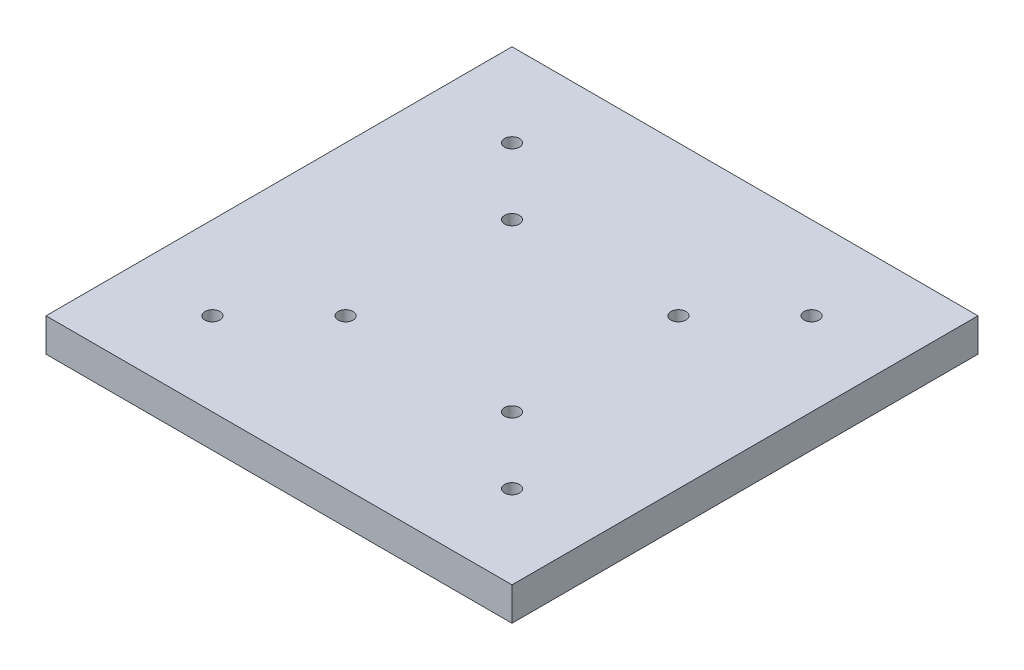
ISO-10303-21;
HEADER;
FILE_DESCRIPTION(('STEP AP214'),'2;1');
FILE_NAME('part.step','',(''),(''),'','','');
FILE_SCHEMA(('AUTOMOTIVE_DESIGN { 1 0 10303 214 1 1 1 1 }'));
ENDSEC;
DATA;
#1=APPLICATION_CONTEXT('core data for automotive mechanical design processes');
#2=APPLICATION_PROTOCOL_DEFINITION('international standard','automotive_design',2000,#1);
#3=PRODUCT_CONTEXT('',#1,'mechanical');
#4=PRODUCT('Part','Part','',(#3));
#5=PRODUCT_RELATED_PRODUCT_CATEGORY('part','',(#4));
#6=PRODUCT_DEFINITION_FORMATION('','',#4);
#7=PRODUCT_DEFINITION_CONTEXT('part definition',#1,'design');
#8=PRODUCT_DEFINITION('design','',#6,#7);
#9=PRODUCT_DEFINITION_SHAPE('','',#8);
#10=(LENGTH_UNIT() NAMED_UNIT(*) SI_UNIT(.MILLI.,.METRE.));
#11=(NAMED_UNIT(*) PLANE_ANGLE_UNIT() SI_UNIT($,.RADIAN.));
#12=(NAMED_UNIT(*) SI_UNIT($,.STERADIAN.) SOLID_ANGLE_UNIT());
#13=UNCERTAINTY_MEASURE_WITH_UNIT(LENGTH_MEASURE(1.E-05),#10,'distance_accuracy_value','');
#14=(GEOMETRIC_REPRESENTATION_CONTEXT(3) GLOBAL_UNCERTAINTY_ASSIGNED_CONTEXT((#13)) GLOBAL_UNIT_ASSIGNED_CONTEXT((#10,
#11,#12)) REPRESENTATION_CONTEXT('',''));
#15=CARTESIAN_POINT('',(0.,0.,0.));
#16=DIRECTION('',(0.,0.,1.));
#17=DIRECTION('',(1.,0.,0.));
#18=AXIS2_PLACEMENT_3D('',#15,#16,#17);
#19=CARTESIAN_POINT('',(0.,0.,0.));
#20=DIRECTION('',(0.,-1.,0.));
#21=DIRECTION('',(0.,0.,-1.));
#22=AXIS2_PLACEMENT_3D('',#19,#20,#21);
#23=PLANE('',#22);
#24=CARTESIAN_POINT('',(-45.,0.,-45.));
#25=DIRECTION('',(0.,1.,0.));
#26=DIRECTION('',(0.,0.,1.));
#27=AXIS2_PLACEMENT_3D('',#24,#25,#26);
#28=CIRCLE('',#27,2.24999999999999);
#29=CARTESIAN_POINT('',(-45.,0.,-42.75));
#30=VERTEX_POINT('',#29);
#31=EDGE_CURVE('E185',#30,#30,#28,.T.);
#32=ORIENTED_EDGE('',*,*,#31,.F.);
#33=EDGE_LOOP('',(#32));
#34=FACE_BOUND('',#33,.T.);
#35=CARTESIAN_POINT('',(-45.,0.,45.));
#36=DIRECTION('',(0.,1.,0.));
#37=DIRECTION('',(0.,0.,1.));
#38=AXIS2_PLACEMENT_3D('',#35,#36,#37);
#39=CIRCLE('',#38,2.24999999999999);
#40=CARTESIAN_POINT('',(-45.,0.,47.25));
#41=VERTEX_POINT('',#40);
#42=EDGE_CURVE('E189',#41,#41,#39,.T.);
#43=ORIENTED_EDGE('',*,*,#42,.F.);
#44=EDGE_LOOP('',(#43));
#45=FACE_BOUND('',#44,.T.);
#46=CARTESIAN_POINT('',(45.,0.,45.));
#47=DIRECTION('',(0.,1.,0.));
#48=DIRECTION('',(0.,0.,1.));
#49=AXIS2_PLACEMENT_3D('',#46,#47,#48);
#50=CIRCLE('',#49,2.24999999999999);
#51=CARTESIAN_POINT('',(45.,0.,47.25));
#52=VERTEX_POINT('',#51);
#53=EDGE_CURVE('E199',#52,#52,#50,.T.);
#54=ORIENTED_EDGE('',*,*,#53,.F.);
#55=EDGE_LOOP('',(#54));
#56=FACE_BOUND('',#55,.T.);
#57=CARTESIAN_POINT('',(45.,0.,-45.));
#58=DIRECTION('',(0.,1.,0.));
#59=DIRECTION('',(0.,0.,1.));
#60=AXIS2_PLACEMENT_3D('',#57,#58,#59);
#61=CIRCLE('',#60,2.24999999999999);
#62=CARTESIAN_POINT('',(45.,0.,-42.75));
#63=VERTEX_POINT('',#62);
#64=EDGE_CURVE('E207',#63,#63,#61,.T.);
#65=ORIENTED_EDGE('',*,*,#64,.F.);
#66=EDGE_LOOP('',(#65));
#67=FACE_BOUND('',#66,.T.);
#68=CARTESIAN_POINT('',(25.,0.,-25.));
#69=DIRECTION('',(0.,1.,0.));
#70=DIRECTION('',(0.,0.,1.));
#71=AXIS2_PLACEMENT_3D('',#68,#69,#70);
#72=CIRCLE('',#71,2.24999999999999);
#73=CARTESIAN_POINT('',(25.,0.,-22.75));
#74=VERTEX_POINT('',#73);
#75=EDGE_CURVE('E215',#74,#74,#72,.T.);
#76=ORIENTED_EDGE('',*,*,#75,.F.);
#77=EDGE_LOOP('',(#76));
#78=FACE_BOUND('',#77,.T.);
#79=CARTESIAN_POINT('',(-25.,0.,25.));
#80=DIRECTION('',(0.,1.,0.));
#81=DIRECTION('',(0.,0.,1.));
#82=AXIS2_PLACEMENT_3D('',#79,#80,#81);
#83=CIRCLE('',#82,2.24999999999999);
#84=CARTESIAN_POINT('',(-25.,0.,27.25));
#85=VERTEX_POINT('',#84);
#86=EDGE_CURVE('E231',#85,#85,#83,.T.);
#87=ORIENTED_EDGE('',*,*,#86,.F.);
#88=EDGE_LOOP('',(#87));
#89=FACE_BOUND('',#88,.T.);
#90=CARTESIAN_POINT('',(25.,0.,25.));
#91=DIRECTION('',(0.,1.,0.));
#92=DIRECTION('',(0.,0.,1.));
#93=AXIS2_PLACEMENT_3D('',#90,#91,#92);
#94=CIRCLE('',#93,2.24999999999999);
#95=CARTESIAN_POINT('',(25.,0.,27.25));
#96=VERTEX_POINT('',#95);
#97=EDGE_CURVE('E239',#96,#96,#94,.T.);
#98=ORIENTED_EDGE('',*,*,#97,.F.);
#99=EDGE_LOOP('',(#98));
#100=FACE_BOUND('',#99,.T.);
#101=DIRECTION('',(0.,0.,1.));
#102=VECTOR('',#101,1.);
#103=CARTESIAN_POINT('',(-70.,0.,-70.));
#104=LINE('',#103,#102);
#105=CARTESIAN_POINT('',(-70.,0.,-70.));
#106=VERTEX_POINT('',#105);
#107=CARTESIAN_POINT('',(-70.,0.,70.));
#108=VERTEX_POINT('',#107);
#109=EDGE_CURVE('E111',#106,#108,#104,.T.);
#110=ORIENTED_EDGE('',*,*,#109,.T.);
#111=DIRECTION('',(1.,0.,0.));
#112=VECTOR('',#111,1.);
#113=CARTESIAN_POINT('',(70.,0.,70.));
#114=LINE('',#113,#112);
#115=CARTESIAN_POINT('',(70.,0.,70.));
#116=VERTEX_POINT('',#115);
#117=EDGE_CURVE('E115',#108,#116,#114,.T.);
#118=ORIENTED_EDGE('',*,*,#117,.T.);
#119=DIRECTION('',(0.,0.,-1.));
#120=VECTOR('',#119,1.);
#121=CARTESIAN_POINT('',(70.,0.,-70.));
#122=LINE('',#121,#120);
#123=CARTESIAN_POINT('',(70.,0.,-70.));
#124=VERTEX_POINT('',#123);
#125=EDGE_CURVE('E91',#116,#124,#122,.T.);
#126=ORIENTED_EDGE('',*,*,#125,.T.);
#127=DIRECTION('',(-1.,0.,0.));
#128=VECTOR('',#127,1.);
#129=CARTESIAN_POINT('',(70.,0.,-70.));
#130=LINE('',#129,#128);
#131=EDGE_CURVE('E105',#124,#106,#130,.T.);
#132=ORIENTED_EDGE('',*,*,#131,.T.);
#133=EDGE_LOOP('',(#110,#118,#126,#132));
#134=FACE_BOUND('',#133,.T.);
#135=CARTESIAN_POINT('',(-25.,0.,-25.));
#136=DIRECTION('',(0.,1.,0.));
#137=DIRECTION('',(0.,0.,1.));
#138=AXIS2_PLACEMENT_3D('',#135,#136,#137);
#139=CIRCLE('',#138,2.24999999999999);
#140=CARTESIAN_POINT('',(-25.,0.,-22.75));
#141=VERTEX_POINT('',#140);
#142=EDGE_CURVE('E223',#141,#141,#139,.T.);
#143=ORIENTED_EDGE('',*,*,#142,.F.);
#144=EDGE_LOOP('',(#143));
#145=FACE_BOUND('',#144,.T.);
#146=ADVANCED_FACE('F39',(#34,#45,#56,#67,#78,#89,#100,#134,#145),#23,.F.);
#147=CARTESIAN_POINT('',(-70.,-10.,-70.));
#148=DIRECTION('',(-1.,0.,0.));
#149=DIRECTION('',(0.,0.,1.));
#150=AXIS2_PLACEMENT_3D('',#147,#148,#149);
#151=PLANE('',#150);
#152=ORIENTED_EDGE('',*,*,#109,.F.);
#153=DIRECTION('',(0.,1.,0.));
#154=VECTOR('',#153,1.);
#155=CARTESIAN_POINT('',(-70.,-10.,-70.));
#156=LINE('',#155,#154);
#157=CARTESIAN_POINT('',(-70.,-10.,-70.));
#158=VERTEX_POINT('',#157);
#159=EDGE_CURVE('E11',#158,#106,#156,.T.);
#160=ORIENTED_EDGE('',*,*,#159,.F.);
#161=DIRECTION('',(0.,0.,1.));
#162=VECTOR('',#161,1.);
#163=CARTESIAN_POINT('',(-70.,-10.,-70.));
#164=LINE('',#163,#162);
#165=CARTESIAN_POINT('',(-70.,-10.,70.));
#166=VERTEX_POINT('',#165);
#167=EDGE_CURVE('E102',#158,#166,#164,.T.);
#168=ORIENTED_EDGE('',*,*,#167,.T.);
#169=DIRECTION('',(0.,1.,0.));
#170=VECTOR('',#169,1.);
#171=CARTESIAN_POINT('',(-70.,-10.,70.));
#172=LINE('',#171,#170);
#173=EDGE_CURVE('E43',#166,#108,#172,.T.);
#174=ORIENTED_EDGE('',*,*,#173,.T.);
#175=EDGE_LOOP('',(#152,#160,#168,#174));
#176=FACE_BOUND('',#175,.T.);
#177=ADVANCED_FACE('F41',(#176),#151,.T.);
#178=CARTESIAN_POINT('',(70.,-10.,-70.));
#179=DIRECTION('',(0.,0.,-1.));
#180=DIRECTION('',(-1.,0.,0.));
#181=AXIS2_PLACEMENT_3D('',#178,#179,#180);
#182=PLANE('',#181);
#183=ORIENTED_EDGE('',*,*,#131,.F.);
#184=DIRECTION('',(0.,1.,0.));
#185=VECTOR('',#184,1.);
#186=CARTESIAN_POINT('',(70.,-10.,-70.));
#187=LINE('',#186,#185);
#188=CARTESIAN_POINT('',(70.,-10.,-70.));
#189=VERTEX_POINT('',#188);
#190=EDGE_CURVE('E50',#189,#124,#187,.T.);
#191=ORIENTED_EDGE('',*,*,#190,.F.);
#192=DIRECTION('',(-1.,0.,0.));
#193=VECTOR('',#192,1.);
#194=CARTESIAN_POINT('',(70.,-10.,-70.));
#195=LINE('',#194,#193);
#196=EDGE_CURVE('E97',#189,#158,#195,.T.);
#197=ORIENTED_EDGE('',*,*,#196,.T.);
#198=ORIENTED_EDGE('',*,*,#159,.T.);
#199=EDGE_LOOP('',(#183,#191,#197,#198));
#200=FACE_BOUND('',#199,.T.);
#201=ADVANCED_FACE('F128',(#200),#182,.T.);
#202=CARTESIAN_POINT('',(70.,-10.,-70.));
#203=DIRECTION('',(1.,0.,0.));
#204=DIRECTION('',(0.,0.,-1.));
#205=AXIS2_PLACEMENT_3D('',#202,#203,#204);
#206=PLANE('',#205);
#207=ORIENTED_EDGE('',*,*,#125,.F.);
#208=DIRECTION('',(0.,1.,0.));
#209=VECTOR('',#208,1.);
#210=CARTESIAN_POINT('',(70.,-10.,70.));
#211=LINE('',#210,#209);
#212=CARTESIAN_POINT('',(70.,-10.,70.));
#213=VERTEX_POINT('',#212);
#214=EDGE_CURVE('E86',#213,#116,#211,.T.);
#215=ORIENTED_EDGE('',*,*,#214,.F.);
#216=DIRECTION('',(0.,0.,-1.));
#217=VECTOR('',#216,1.);
#218=CARTESIAN_POINT('',(70.,-10.,-70.));
#219=LINE('',#218,#217);
#220=EDGE_CURVE('E89',#213,#189,#219,.T.);
#221=ORIENTED_EDGE('',*,*,#220,.T.);
#222=ORIENTED_EDGE('',*,*,#190,.T.);
#223=EDGE_LOOP('',(#207,#215,#221,#222));
#224=FACE_BOUND('',#223,.T.);
#225=ADVANCED_FACE('F88',(#224),#206,.T.);
#226=CARTESIAN_POINT('',(70.,-10.,70.));
#227=DIRECTION('',(0.,0.,1.));
#228=DIRECTION('',(1.,0.,0.));
#229=AXIS2_PLACEMENT_3D('',#226,#227,#228);
#230=PLANE('',#229);
#231=ORIENTED_EDGE('',*,*,#117,.F.);
#232=ORIENTED_EDGE('',*,*,#173,.F.);
#233=DIRECTION('',(1.,0.,0.));
#234=VECTOR('',#233,1.);
#235=CARTESIAN_POINT('',(70.,-10.,70.));
#236=LINE('',#235,#234);
#237=EDGE_CURVE('E96',#166,#213,#236,.T.);
#238=ORIENTED_EDGE('',*,*,#237,.T.);
#239=ORIENTED_EDGE('',*,*,#214,.T.);
#240=EDGE_LOOP('',(#231,#232,#238,#239));
#241=FACE_BOUND('',#240,.T.);
#242=ADVANCED_FACE('F100',(#241),#230,.T.);
#243=CARTESIAN_POINT('',(0.,-10.,0.));
#244=DIRECTION('',(0.,-1.,0.));
#245=DIRECTION('',(0.,0.,-1.));
#246=AXIS2_PLACEMENT_3D('',#243,#244,#245);
#247=PLANE('',#246);
#248=CARTESIAN_POINT('',(-45.,-10.,-45.));
#249=DIRECTION('',(0.,1.,0.));
#250=DIRECTION('',(0.,0.,1.));
#251=AXIS2_PLACEMENT_3D('',#248,#249,#250);
#252=CIRCLE('',#251,2.24999999999998);
#253=CARTESIAN_POINT('',(-45.,-10.,-42.75));
#254=VERTEX_POINT('',#253);
#255=EDGE_CURVE('E183',#254,#254,#252,.T.);
#256=ORIENTED_EDGE('',*,*,#255,.T.);
#257=EDGE_LOOP('',(#256));
#258=FACE_BOUND('',#257,.T.);
#259=CARTESIAN_POINT('',(-45.,-10.,45.));
#260=DIRECTION('',(0.,1.,0.));
#261=DIRECTION('',(0.,0.,1.));
#262=AXIS2_PLACEMENT_3D('',#259,#260,#261);
#263=CIRCLE('',#262,2.24999999999998);
#264=CARTESIAN_POINT('',(-45.,-10.,47.25));
#265=VERTEX_POINT('',#264);
#266=EDGE_CURVE('E195',#265,#265,#263,.T.);
#267=ORIENTED_EDGE('',*,*,#266,.T.);
#268=EDGE_LOOP('',(#267));
#269=FACE_BOUND('',#268,.T.);
#270=CARTESIAN_POINT('',(45.,-10.,45.));
#271=DIRECTION('',(0.,1.,0.));
#272=DIRECTION('',(0.,0.,1.));
#273=AXIS2_PLACEMENT_3D('',#270,#271,#272);
#274=CIRCLE('',#273,2.24999999999998);
#275=CARTESIAN_POINT('',(45.,-10.,47.25));
#276=VERTEX_POINT('',#275);
#277=EDGE_CURVE('E203',#276,#276,#274,.T.);
#278=ORIENTED_EDGE('',*,*,#277,.T.);
#279=EDGE_LOOP('',(#278));
#280=FACE_BOUND('',#279,.T.);
#281=CARTESIAN_POINT('',(45.,-10.,-45.));
#282=DIRECTION('',(0.,1.,0.));
#283=DIRECTION('',(0.,0.,1.));
#284=AXIS2_PLACEMENT_3D('',#281,#282,#283);
#285=CIRCLE('',#284,2.24999999999998);
#286=CARTESIAN_POINT('',(45.,-10.,-42.75));
#287=VERTEX_POINT('',#286);
#288=EDGE_CURVE('E211',#287,#287,#285,.T.);
#289=ORIENTED_EDGE('',*,*,#288,.T.);
#290=EDGE_LOOP('',(#289));
#291=FACE_BOUND('',#290,.T.);
#292=CARTESIAN_POINT('',(25.,-10.,-25.));
#293=DIRECTION('',(0.,1.,0.));
#294=DIRECTION('',(0.,0.,1.));
#295=AXIS2_PLACEMENT_3D('',#292,#293,#294);
#296=CIRCLE('',#295,2.24999999999998);
#297=CARTESIAN_POINT('',(25.,-10.,-22.75));
#298=VERTEX_POINT('',#297);
#299=EDGE_CURVE('E219',#298,#298,#296,.T.);
#300=ORIENTED_EDGE('',*,*,#299,.T.);
#301=EDGE_LOOP('',(#300));
#302=FACE_BOUND('',#301,.T.);
#303=CARTESIAN_POINT('',(-25.,-10.,-25.));
#304=DIRECTION('',(0.,1.,0.));
#305=DIRECTION('',(0.,0.,1.));
#306=AXIS2_PLACEMENT_3D('',#303,#304,#305);
#307=CIRCLE('',#306,2.24999999999998);
#308=CARTESIAN_POINT('',(-25.,-10.,-22.75));
#309=VERTEX_POINT('',#308);
#310=EDGE_CURVE('E227',#309,#309,#307,.T.);
#311=ORIENTED_EDGE('',*,*,#310,.T.);
#312=EDGE_LOOP('',(#311));
#313=FACE_BOUND('',#312,.T.);
#314=CARTESIAN_POINT('',(-25.,-10.,25.));
#315=DIRECTION('',(0.,1.,0.));
#316=DIRECTION('',(0.,0.,1.));
#317=AXIS2_PLACEMENT_3D('',#314,#315,#316);
#318=CIRCLE('',#317,2.24999999999998);
#319=CARTESIAN_POINT('',(-25.,-10.,27.25));
#320=VERTEX_POINT('',#319);
#321=EDGE_CURVE('E235',#320,#320,#318,.T.);
#322=ORIENTED_EDGE('',*,*,#321,.T.);
#323=EDGE_LOOP('',(#322));
#324=FACE_BOUND('',#323,.T.);
#325=CARTESIAN_POINT('',(25.,-10.,25.));
#326=DIRECTION('',(0.,1.,0.));
#327=DIRECTION('',(0.,0.,1.));
#328=AXIS2_PLACEMENT_3D('',#325,#326,#327);
#329=CIRCLE('',#328,2.24999999999998);
#330=CARTESIAN_POINT('',(25.,-10.,27.25));
#331=VERTEX_POINT('',#330);
#332=EDGE_CURVE('E116',#331,#331,#329,.T.);
#333=ORIENTED_EDGE('',*,*,#332,.T.);
#334=EDGE_LOOP('',(#333));
#335=FACE_BOUND('',#334,.T.);
#336=ORIENTED_EDGE('',*,*,#167,.F.);
#337=ORIENTED_EDGE('',*,*,#196,.F.);
#338=ORIENTED_EDGE('',*,*,#220,.F.);
#339=ORIENTED_EDGE('',*,*,#237,.F.);
#340=EDGE_LOOP('',(#336,#337,#338,#339));
#341=FACE_BOUND('',#340,.T.);
#342=ADVANCED_FACE('F95',(#258,#269,#280,#291,#302,#313,#324,#335,#341),#247,.T.);
#343=CARTESIAN_POINT('',(25.,0.,25.));
#344=DIRECTION('',(0.,1.,0.));
#345=DIRECTION('',(0.,0.,1.));
#346=AXIS2_PLACEMENT_3D('',#343,#344,#345);
#347=CYLINDRICAL_SURFACE('',#346,2.24999999999998);
#348=ORIENTED_EDGE('',*,*,#332,.F.);
#349=EDGE_LOOP('',(#348));
#350=FACE_BOUND('',#349,.T.);
#351=ORIENTED_EDGE('',*,*,#97,.T.);
#352=EDGE_LOOP('',(#351));
#353=FACE_BOUND('',#352,.T.);
#354=ADVANCED_FACE('F146',(#350,#353),#347,.F.);
#355=CARTESIAN_POINT('',(-25.,0.,25.));
#356=DIRECTION('',(0.,1.,0.));
#357=DIRECTION('',(0.,0.,1.));
#358=AXIS2_PLACEMENT_3D('',#355,#356,#357);
#359=CYLINDRICAL_SURFACE('',#358,2.24999999999998);
#360=ORIENTED_EDGE('',*,*,#321,.F.);
#361=EDGE_LOOP('',(#360));
#362=FACE_BOUND('',#361,.T.);
#363=ORIENTED_EDGE('',*,*,#86,.T.);
#364=EDGE_LOOP('',(#363));
#365=FACE_BOUND('',#364,.T.);
#366=ADVANCED_FACE('F150',(#362,#365),#359,.F.);
#367=CARTESIAN_POINT('',(-25.,0.,-25.));
#368=DIRECTION('',(0.,1.,0.));
#369=DIRECTION('',(0.,0.,1.));
#370=AXIS2_PLACEMENT_3D('',#367,#368,#369);
#371=CYLINDRICAL_SURFACE('',#370,2.24999999999998);
#372=ORIENTED_EDGE('',*,*,#310,.F.);
#373=EDGE_LOOP('',(#372));
#374=FACE_BOUND('',#373,.T.);
#375=ORIENTED_EDGE('',*,*,#142,.T.);
#376=EDGE_LOOP('',(#375));
#377=FACE_BOUND('',#376,.T.);
#378=ADVANCED_FACE('F154',(#374,#377),#371,.F.);
#379=CARTESIAN_POINT('',(25.,0.,-25.));
#380=DIRECTION('',(0.,1.,0.));
#381=DIRECTION('',(0.,0.,1.));
#382=AXIS2_PLACEMENT_3D('',#379,#380,#381);
#383=CYLINDRICAL_SURFACE('',#382,2.24999999999998);
#384=ORIENTED_EDGE('',*,*,#299,.F.);
#385=EDGE_LOOP('',(#384));
#386=FACE_BOUND('',#385,.T.);
#387=ORIENTED_EDGE('',*,*,#75,.T.);
#388=EDGE_LOOP('',(#387));
#389=FACE_BOUND('',#388,.T.);
#390=ADVANCED_FACE('F158',(#386,#389),#383,.F.);
#391=CARTESIAN_POINT('',(45.,0.,-45.));
#392=DIRECTION('',(0.,1.,0.));
#393=DIRECTION('',(0.,0.,1.));
#394=AXIS2_PLACEMENT_3D('',#391,#392,#393);
#395=CYLINDRICAL_SURFACE('',#394,2.24999999999998);
#396=ORIENTED_EDGE('',*,*,#288,.F.);
#397=EDGE_LOOP('',(#396));
#398=FACE_BOUND('',#397,.T.);
#399=ORIENTED_EDGE('',*,*,#64,.T.);
#400=EDGE_LOOP('',(#399));
#401=FACE_BOUND('',#400,.T.);
#402=ADVANCED_FACE('F162',(#398,#401),#395,.F.);
#403=CARTESIAN_POINT('',(45.,0.,45.));
#404=DIRECTION('',(0.,1.,0.));
#405=DIRECTION('',(0.,0.,1.));
#406=AXIS2_PLACEMENT_3D('',#403,#404,#405);
#407=CYLINDRICAL_SURFACE('',#406,2.24999999999998);
#408=ORIENTED_EDGE('',*,*,#277,.F.);
#409=EDGE_LOOP('',(#408));
#410=FACE_BOUND('',#409,.T.);
#411=ORIENTED_EDGE('',*,*,#53,.T.);
#412=EDGE_LOOP('',(#411));
#413=FACE_BOUND('',#412,.T.);
#414=ADVANCED_FACE('F166',(#410,#413),#407,.F.);
#415=CARTESIAN_POINT('',(-45.,0.,45.));
#416=DIRECTION('',(0.,1.,0.));
#417=DIRECTION('',(0.,0.,1.));
#418=AXIS2_PLACEMENT_3D('',#415,#416,#417);
#419=CYLINDRICAL_SURFACE('',#418,2.24999999999998);
#420=ORIENTED_EDGE('',*,*,#266,.F.);
#421=EDGE_LOOP('',(#420));
#422=FACE_BOUND('',#421,.T.);
#423=ORIENTED_EDGE('',*,*,#42,.T.);
#424=EDGE_LOOP('',(#423));
#425=FACE_BOUND('',#424,.T.);
#426=ADVANCED_FACE('F170',(#422,#425),#419,.F.);
#427=CARTESIAN_POINT('',(-45.,0.,-45.));
#428=DIRECTION('',(0.,1.,0.));
#429=DIRECTION('',(0.,0.,1.));
#430=AXIS2_PLACEMENT_3D('',#427,#428,#429);
#431=CYLINDRICAL_SURFACE('',#430,2.24999999999998);
#432=ORIENTED_EDGE('',*,*,#255,.F.);
#433=EDGE_LOOP('',(#432));
#434=FACE_BOUND('',#433,.T.);
#435=ORIENTED_EDGE('',*,*,#31,.T.);
#436=EDGE_LOOP('',(#435));
#437=FACE_BOUND('',#436,.T.);
#438=ADVANCED_FACE('F174',(#434,#437),#431,.F.);
#439=CLOSED_SHELL('',(#146,#177,#201,#225,#242,#342,#354,#366,#378,#390,#402,#414,#426,#438));
#440=MANIFOLD_SOLID_BREP('B2',#439);
#441=ADVANCED_BREP_SHAPE_REPRESENTATION('',(#18,#440),#14);
#442=SHAPE_DEFINITION_REPRESENTATION(#9,#441);
ENDSEC;
END-ISO-10303-21;
